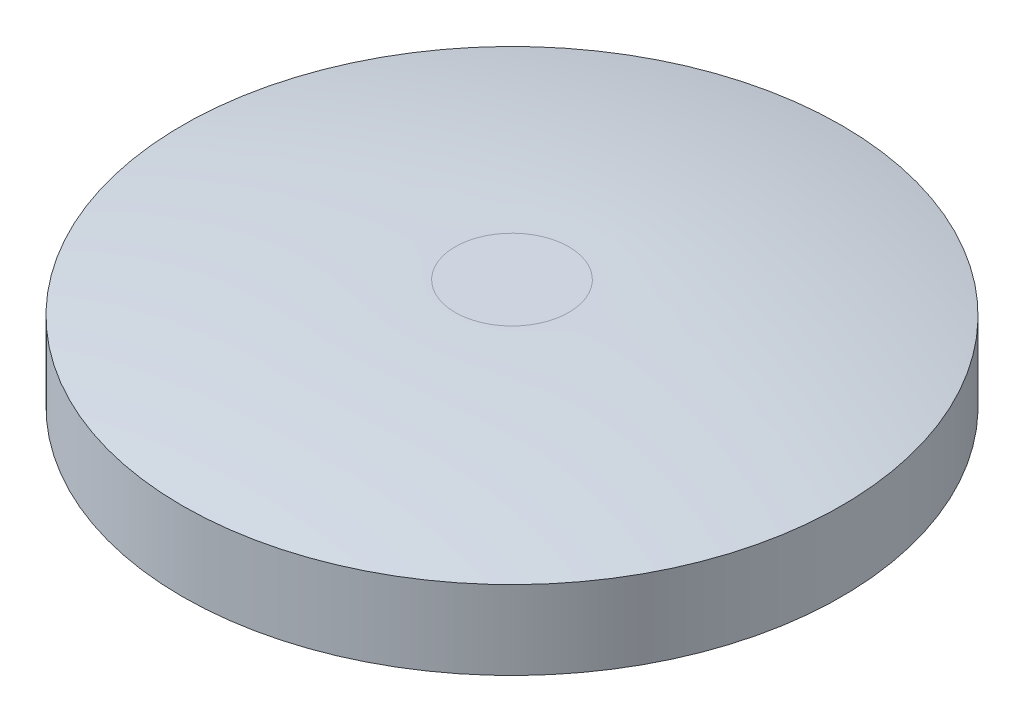
ISO-10303-21;
HEADER;
FILE_DESCRIPTION(('STEP AP214'),'2;1');
FILE_NAME('part.step','',(''),(''),'','','');
FILE_SCHEMA(('AUTOMOTIVE_DESIGN { 1 0 10303 214 1 1 1 1 }'));
ENDSEC;
DATA;
#1=APPLICATION_CONTEXT('core data for automotive mechanical design processes');
#2=APPLICATION_PROTOCOL_DEFINITION('international standard','automotive_design',2000,#1);
#3=PRODUCT_CONTEXT('',#1,'mechanical');
#4=PRODUCT('Part','Part','',(#3));
#5=PRODUCT_RELATED_PRODUCT_CATEGORY('part','',(#4));
#6=PRODUCT_DEFINITION_FORMATION('','',#4);
#7=PRODUCT_DEFINITION_CONTEXT('part definition',#1,'design');
#8=PRODUCT_DEFINITION('design','',#6,#7);
#9=PRODUCT_DEFINITION_SHAPE('','',#8);
#10=(LENGTH_UNIT() NAMED_UNIT(*) SI_UNIT(.MILLI.,.METRE.));
#11=(NAMED_UNIT(*) PLANE_ANGLE_UNIT() SI_UNIT($,.RADIAN.));
#12=(NAMED_UNIT(*) SI_UNIT($,.STERADIAN.) SOLID_ANGLE_UNIT());
#13=UNCERTAINTY_MEASURE_WITH_UNIT(LENGTH_MEASURE(1.E-05),#10,'distance_accuracy_value','');
#14=(GEOMETRIC_REPRESENTATION_CONTEXT(3) GLOBAL_UNCERTAINTY_ASSIGNED_CONTEXT((#13)) GLOBAL_UNIT_ASSIGNED_CONTEXT((#10,
#11,#12)) REPRESENTATION_CONTEXT('',''));
#15=CARTESIAN_POINT('',(0.,0.,0.));
#16=DIRECTION('',(0.,0.,1.));
#17=DIRECTION('',(1.,0.,0.));
#18=AXIS2_PLACEMENT_3D('',#15,#16,#17);
#19=CARTESIAN_POINT('',(0.,1.,0.));
#20=DIRECTION('',(0.,1.,0.));
#21=DIRECTION('',(0.,0.,1.));
#22=AXIS2_PLACEMENT_3D('',#19,#20,#21);
#23=PLANE('',#22);
#24=CARTESIAN_POINT('',(-1.21702915796217E-12,0.999999999999487,0.));
#25=DIRECTION('',(0.,1.,0.));
#26=DIRECTION('',(0.,0.,1.));
#27=AXIS2_PLACEMENT_3D('',#24,#25,#26);
#28=CIRCLE('',#27,5.869643720003);
#29=CARTESIAN_POINT('',(-1.21702915796217E-12,0.999999999999487,5.869643720003));
#30=VERTEX_POINT('',#29);
#31=EDGE_CURVE('E21',#30,#30,#28,.F.);
#32=ORIENTED_EDGE('',*,*,#31,.T.);
#33=EDGE_LOOP('',(#32));
#34=FACE_BOUND('',#33,.T.);
#35=ADVANCED_FACE('F16',(#34),#23,.F.);
#36=CARTESIAN_POINT('',(-1.2170711487236E-12,-73.072771739869,0.));
#37=DIRECTION('',(0.,1.,0.));
#38=DIRECTION('',(0.,0.,1.));
#39=AXIS2_PLACEMENT_3D('',#36,#37,#38);
#40=DEGENERATE_TOROIDAL_SURFACE('',#39,5.86964372000849,74.0727717398685,.T.);
#41=ORIENTED_EDGE('',*,*,#31,.F.);
#42=EDGE_LOOP('',(#41));
#43=FACE_BOUND('',#42,.T.);
#44=CARTESIAN_POINT('',(0.,0.,0.));
#45=DIRECTION('',(0.,1.,0.));
#46=DIRECTION('',(0.,0.,1.));
#47=AXIS2_PLACEMENT_3D('',#44,#45,#46);
#48=CIRCLE('',#47,18.);
#49=CARTESIAN_POINT('',(0.,0.,18.));
#50=VERTEX_POINT('',#49);
#51=EDGE_CURVE('E35',#50,#50,#48,.T.);
#52=ORIENTED_EDGE('',*,*,#51,.F.);
#53=EDGE_LOOP('',(#52));
#54=FACE_BOUND('',#53,.T.);
#55=ADVANCED_FACE('F40',(#43,#54),#40,.F.);
#56=CARTESIAN_POINT('',(0.,6.,0.));
#57=DIRECTION('',(0.,1.,0.));
#58=DIRECTION('',(0.,0.,1.));
#59=AXIS2_PLACEMENT_3D('',#56,#57,#58);
#60=PLANE('',#59);
#61=CARTESIAN_POINT('',(2.33026192273726E-12,5.99999999999986,3.10527525103699));
#62=CARTESIAN_POINT('',(-0.0557798827298015,5.99999999997448,3.10525667714382));
#63=CARTESIAN_POINT('',(-0.1115580223475,5.99999999999398,3.10375197361228));
#64=CARTESIAN_POINT('',(-0.222956271130952,6.00000000000563,3.09777808126887));
#65=CARTESIAN_POINT('',(-0.278576377596615,5.99999999999778,3.09330884210839));
#66=CARTESIAN_POINT('',(-0.389505027845718,5.9999999998376,3.08141334082715));
#67=CARTESIAN_POINT('',(-0.444813555087367,5.99999999968527,3.07398692318208));
#68=CARTESIAN_POINT('',(-0.527418920552798,5.99999999899345,3.0606569331651));
#69=CARTESIAN_POINT('',(-0.554896522256398,5.99999999868558,3.0558480990134));
#70=CARTESIAN_POINT('',(-0.609675053168411,5.99999999798358,3.04549335554243));
#71=CARTESIAN_POINT('',(-0.636976168386664,5.99999999758955,3.03994843243975));
#72=CARTESIAN_POINT('',(-0.718631883859921,5.99999999668156,3.02217406949885));
#73=CARTESIAN_POINT('',(-0.772742197112823,5.99999999644158,3.00880450143616));
#74=CARTESIAN_POINT('',(-0.880149008842378,5.99999999693832,2.97912693977043));
#75=CARTESIAN_POINT('',(-0.933445524723966,5.99999999767502,2.96281900910681));
#76=CARTESIAN_POINT('',(-1.03900288920495,5.99999999909743,2.92716058608882));
#77=CARTESIAN_POINT('',(-1.09126384431346,5.99999999978313,2.90781040848278));
#78=CARTESIAN_POINT('',(-1.1799554432403,6.00000000015442,2.87258527487248));
#79=CARTESIAN_POINT('',(-1.21662660155596,6.00000000007048,2.85730576259389));
#80=CARTESIAN_POINT('',(-1.31397462866956,5.99999999979306,2.814539379831));
#81=CARTESIAN_POINT('',(-1.37410798709275,5.99999999956389,2.78578717779275));
#82=CARTESIAN_POINT('',(-1.44876891650492,5.99999999883825,2.74709879587628));
#83=CARTESIAN_POINT('',(-1.46423032259533,5.99999999866347,2.73892075596955));
#84=CARTESIAN_POINT('',(-1.53394517491911,5.99999999784658,2.70128092837278));
#85=CARTESIAN_POINT('',(-1.58740042823527,5.99999999714062,2.67030540781104));
#86=CARTESIAN_POINT('',(-1.66188932940621,5.99999999659025,2.62406229104348));
#87=CARTESIAN_POINT('',(-1.68374872261745,5.99999999648363,2.61010182936937));
#88=CARTESIAN_POINT('',(-1.73066216884211,5.9999999963933,2.57929137634363));
#89=CARTESIAN_POINT('',(-1.75565188211689,5.99999999643263,2.5623431245629));
#90=CARTESIAN_POINT('',(-1.82985145940309,5.99999999668454,2.51040409855918));
#91=CARTESIAN_POINT('',(-1.87829815982521,5.99999999703102,2.47431511543034));
#92=CARTESIAN_POINT('',(-1.97299116018061,5.99999999799499,2.39936455140583));
#93=CARTESIAN_POINT('',(-2.01923757603544,5.99999999861247,2.36050311684643));
#94=CARTESIAN_POINT('',(-2.1092905844008,5.99999999956369,2.28005914985439));
#95=CARTESIAN_POINT('',(-2.1530973991718,5.99999999989746,2.23847686605859));
#96=CARTESIAN_POINT('',(-2.22503397655281,6.00000000007012,2.16645279500627));
#97=CARTESIAN_POINT('',(-2.25376866232929,6.00000000003145,2.13661083354845));
#98=CARTESIAN_POINT('',(-2.30147973850993,5.99999999990851,2.08505181862818));
#99=CARTESIAN_POINT('',(-2.32076710864066,5.99999999984167,2.06362266439735));
#100=CARTESIAN_POINT('',(-2.36352001486921,5.99999999956038,2.01478212739965));
#101=CARTESIAN_POINT('',(-2.38681592620388,5.99999999931303,1.98722205931191));
#102=CARTESIAN_POINT('',(-2.43629575790204,5.9999999986314,1.926564630304));
#103=CARTESIAN_POINT('',(-2.46229999976722,5.99999999817256,1.89332042892011));
#104=CARTESIAN_POINT('',(-2.50982402826319,5.99999999736512,1.8299092635605));
#105=CARTESIAN_POINT('',(-2.531503738188,5.99999999700991,1.79986204328958));
#106=CARTESIAN_POINT('',(-2.56741150115898,5.99999999661186,1.74813126005927));
#107=CARTESIAN_POINT('',(-2.58192316144935,5.99999999650726,1.726644094921));
#108=CARTESIAN_POINT('',(-2.61273540183945,5.99999999641827,1.67974220929204));
#109=CARTESIAN_POINT('',(-2.62893754972517,5.99999999645647,1.65426287544022));
#110=CARTESIAN_POINT('',(-2.67640579948156,5.99999999670737,1.57712692664554));
#111=CARTESIAN_POINT('',(-2.70653801270414,5.9999999970563,1.52476621189469));
#112=CARTESIAN_POINT('',(-2.76366328107758,5.99999999800282,1.41836702041648));
#113=CARTESIAN_POINT('',(-2.79065650114772,5.99999999860039,1.36432863202142));
#114=CARTESIAN_POINT('',(-2.84139082351762,5.99999999958782,1.25475084904769));
#115=CARTESIAN_POINT('',(-2.86513222138676,5.9999999999777,1.19921159143837));
#116=CARTESIAN_POINT('',(-2.90767685853559,6.00000000002033,1.09114706245834));
#117=CARTESIAN_POINT('',(-2.92671870231919,5.99999999972709,1.03871531445593));
#118=CARTESIAN_POINT('',(-2.9620722134773,5.99999999948907,0.932940241277406));
#119=CARTESIAN_POINT('',(-2.97838395332802,5.99999999954429,0.87959694034179));
#120=CARTESIAN_POINT('',(-3.00816820783421,6.00000000006989,0.772118869706534));
#121=CARTESIAN_POINT('',(-3.0216405187127,6.0000000005403,0.717984043499527));
#122=CARTESIAN_POINT('',(-3.03982075008255,5.99999999925814,0.636330711923945));
#123=CARTESIAN_POINT('',(-3.04554325895609,5.99999999849928,0.609034999911849));
#124=CARTESIAN_POINT('',(-3.05314442550151,5.99999999797591,0.569584501975838));
#125=CARTESIAN_POINT('',(-3.05538296321541,5.99999999789266,0.557499287624373));
#126=CARTESIAN_POINT('',(-3.06330185461688,5.99999999777636,0.513165190900821));
#127=CARTESIAN_POINT('',(-3.06851010152395,5.99999999805749,0.480831722837093));
#128=CARTESIAN_POINT('',(-3.08066711761153,5.99999999871544,0.396902197917423));
#129=CARTESIAN_POINT('',(-3.0868312739591,5.99999999905092,0.345190192173577));
#130=CARTESIAN_POINT('',(-3.09450457343303,5.9999999994886,0.26327693948771));
#131=CARTESIAN_POINT('',(-3.0968816857392,5.99999999962962,0.233153874706185));
#132=CARTESIAN_POINT('',(-3.10043679316484,5.99999999981965,0.177875371750722));
#133=CARTESIAN_POINT('',(-3.10174859318507,5.99999999988007,0.152728534843713));
#134=CARTESIAN_POINT('',(-3.10445936537743,5.99999999998747,0.0850703439177172));
#135=CARTESIAN_POINT('',(-3.10529535575089,5.99999999999648,0.0425356281595641));
#136=CARTESIAN_POINT('',(-3.10524892583805,6.00000000000429,-0.055696334708853));
#137=CARTESIAN_POINT('',(-3.10375479167715,5.99999999999906,-0.111394233766092));
#138=CARTESIAN_POINT('',(-3.09776151034657,5.99999999999288,-0.222627459760753));
#139=CARTESIAN_POINT('',(-3.09326237933502,5.99999999999193,-0.278162787570723));
#140=CARTESIAN_POINT('',(-3.08129188903354,5.99999999999097,-0.388911904631839));
#141=CARTESIAN_POINT('',(-3.0738205342776,5.99999999999098,-0.444125694373348));
#142=CARTESIAN_POINT('',(-3.05592172811457,5.99999999999315,-0.554072531681186));
#143=CARTESIAN_POINT('',(-3.04549426983111,5.99999999999531,-0.608805578128925));
#144=CARTESIAN_POINT('',(-3.02171520301367,5.99999999999899,-0.717632012140015));
#145=CARTESIAN_POINT('',(-3.00836357641531,6.00000000000051,-0.7717253957496));
#146=CARTESIAN_POINT('',(-2.97877246904153,5.99999999999863,-0.879120973292945));
#147=CARTESIAN_POINT('',(-2.96253295930416,5.99999999999522,-0.932423159286151));
#148=CARTESIAN_POINT('',(-2.93781300591527,5.99999999998188,-1.00637495735342));
#149=CARTESIAN_POINT('',(-2.9305228288928,5.99999999997708,-1.02742870758817));
#150=CARTESIAN_POINT('',(-2.91082263877145,5.99999999996189,-1.08240230588175));
#151=CARTESIAN_POINT('',(-2.89804508959417,5.99999999994986,-1.11619115399598));
#152=CARTESIAN_POINT('',(-2.86240925475575,5.99999999991248,-1.20567264069874));
#153=CARTESIAN_POINT('',(-2.83850849150237,5.99999999988361,-1.26095352676315));
#154=CARTESIAN_POINT('',(-2.78753425443161,5.99999999981627,-1.37003070328919));
#155=CARTESIAN_POINT('',(-2.76046073213231,5.9999999997778,-1.4238269710493));
#156=CARTESIAN_POINT('',(-2.70323120166492,5.99999999969326,-1.52975594568429));
#157=CARTESIAN_POINT('',(-2.67307514901012,5.99999999964718,-1.58188862853626));
#158=CARTESIAN_POINT('',(-2.60978285248862,5.9999999995491,-1.68431315036905));
#159=CARTESIAN_POINT('',(-2.576646568141,5.99999999949711,-1.73460496433202));
#160=CARTESIAN_POINT('',(-2.5075057575613,5.99999999938883,-1.83317775289258));
#161=CARTESIAN_POINT('',(-2.4715011948032,5.99999999933255,-1.88145870187093));
#162=CARTESIAN_POINT('',(-2.39674560837815,5.99999999921728,-1.97584626992498));
#163=CARTESIAN_POINT('',(-2.35799455206675,5.99999999915829,-2.02195286314574));
#164=CARTESIAN_POINT('',(-2.27787702455669,5.99999999903879,-2.11183571740905));
#165=CARTESIAN_POINT('',(-2.23651052449058,5.99999999897829,-2.15561195272091));
#166=CARTESIAN_POINT('',(-2.15130203848558,5.99999999885794,-2.24068574680227));
#167=CARTESIAN_POINT('',(-2.1074600273242,5.99999999879809,-2.28198328030793));
#168=CARTESIAN_POINT('',(-2.01744876540565,5.99999999867709,-2.3619604933229));
#169=CARTESIAN_POINT('',(-1.97127949291105,5.99999999861594,-2.40064014837243));
#170=CARTESIAN_POINT('',(-1.87878398491679,5.99999999850758,-2.47365856581796));
#171=CARTESIAN_POINT('',(-1.83254826247256,5.99999999845989,-2.50811206623986));
#172=CARTESIAN_POINT('',(-1.73822864101199,5.99999999838952,-2.57438997142164));
#173=CARTESIAN_POINT('',(-1.69014473308487,5.99999999836683,-2.60621436350331));
#174=CARTESIAN_POINT('',(-1.59227878197979,5.99999999834499,-2.66713518338707));
#175=CARTESIAN_POINT('',(-1.54249673622216,5.99999999834584,-2.69623160704481));
#176=CARTESIAN_POINT('',(-1.44138912538885,5.99999999837179,-2.75160599433959));
#177=CARTESIAN_POINT('',(-1.39006356306631,5.99999999839689,-2.77788396300347));
#178=CARTESIAN_POINT('',(-1.28602853674634,5.9999999984695,-2.8275397588422));
#179=CARTESIAN_POINT('',(-1.23331907978922,5.999999998517,-2.85091760076747));
#180=CARTESIAN_POINT('',(-1.12668014148764,5.9999999986312,-2.89470048956303));
#181=CARTESIAN_POINT('',(-1.07275067038184,5.99999999869789,-2.91510556137088));
#182=CARTESIAN_POINT('',(-0.963839394097057,5.99999999884562,-2.95287951779896));
#183=CARTESIAN_POINT('',(-0.908857601229356,5.99999999892665,-2.97024843791556));
#184=CARTESIAN_POINT('',(-0.798012644647377,5.99999999909659,-3.00189617241869));
#185=CARTESIAN_POINT('',(-0.742149494161611,5.99999999918551,-3.01617503313743));
#186=CARTESIAN_POINT('',(-0.629715525651068,5.9999999993632,-3.04159830784609));
#187=CARTESIAN_POINT('',(-0.573144720593973,5.99999999945198,-3.05274277918566));
#188=CARTESIAN_POINT('',(-0.459471356452962,5.99999999961973,-3.07186289229995));
#189=CARTESIAN_POINT('',(-0.402368808882073,5.99999999969869,-3.07983860252061));
#190=CARTESIAN_POINT('',(-0.287809483080168,5.99999999983568,-3.0925959702412));
#191=CARTESIAN_POINT('',(-0.230352713706643,5.9999999998937,-3.09737770728371));
#192=CARTESIAN_POINT('',(-0.115263714928813,5.99999999997565,-3.10373452302853));
#193=CARTESIAN_POINT('',(-0.0576314905197108,5.99999999999957,-3.1053096921824));
#194=CARTESIAN_POINT('',(0.,5.99999999999986,-3.105275251037));
#195=B_SPLINE_CURVE_WITH_KNOTS('',3,(#61,#62,#63,#64,#65,#66,#67,#68,#69,#70,#71,#72,#73,#74,
#75,#76,#77,#78,#79,#80,#81,#82,#83,#84,#85,#86,#87,#88,#89,#90,#91,#92,#93,#94,#95,#96,#97,#98,
#99,#100,#101,#102,#103,#104,#105,#106,#107,#108,#109,#110,#111,#112,#113,#114,#115,#116,#117,
#118,#119,#120,#121,#122,#123,#124,#125,#126,#127,#128,#129,#130,#131,#132,#133,#134,#135,#136,
#137,#138,#139,#140,#141,#142,#143,#144,#145,#146,#147,#148,#149,#150,#151,#152,#153,#154,#155,
#156,#157,#158,#159,#160,#161,#162,#163,#164,#165,#166,#167,#168,#169,#170,#171,#172,#173,#174,
#175,#176,#177,#178,#179,#180,#181,#182,#183,#184,#185,#186,#187,#188,#189,#190,#191,#192,#193,
#194),.UNSPECIFIED.,.F.,.F.,(4,2,2,2,2,2,2,2,2,2,2,2,2,2,2,2,2,2,2,2,2,2,2,2,2,2,2,2,2,2,2,2,2,
2,2,2,2,2,2,2,2,2,2,2,2,2,2,2,2,2,2,2,2,2,2,2,2,2,2,2,2,2,2,2,2,2,4),(0.,0.167317473088868,
0.334637787910105,0.50196690362594,0.585644034649692,0.669210165197918,0.836332283902437,
1.00345082329424,1.17055208410518,1.28971767775962,1.48950221722547,1.54197569174973,
1.72717397588154,1.80497955287813,1.89555177300485,2.07667370848187,2.25778609099577,
2.43888194613634,2.56313675299034,2.6496181413211,2.75785686085035,2.88443985368734,
2.99557067449784,3.07334793677577,3.16392008929676,3.34504190190418,3.52615419426609,
3.70725001376494,3.87452297863889,4.04179150220469,4.20907202602747,4.29272902491159,
4.32960023701195,4.42783444008697,4.58399403472865,4.67463287598574,4.7501690457977,
4.8777629988914,5.04483507060676,5.211906243969,5.37897716247286,5.54604846961303,
5.71312080888425,5.88019482378119,5.947031798223,6.05538287200558,6.23595401398446,
6.41652791557361,6.5971044235515,6.77768338469658,6.95826464578731,7.13884805360215,
7.31943345491954,7.50002069651794,7.68060962517579,7.85350368730167,8.02639858311646,
8.19929374159003,8.37218859169224,8.54508256239297,8.71797508266209,8.89086558146952,
9.06375348778523,9.23663823057923,9.40951923882161,9.58239594148251,9.7552677675322),.UNSPECIFIED.);
#196=CARTESIAN_POINT('',(1.2009834083219E-12,5.99999999999987,3.10527525103837));
#197=VERTEX_POINT('',#196);
#198=CARTESIAN_POINT('',(0.,5.99999999999986,-3.10527525103699));
#199=VERTEX_POINT('',#198);
#200=EDGE_CURVE('E32',#197,#199,#195,.T.);
#201=ORIENTED_EDGE('',*,*,#200,.F.);
#202=CARTESIAN_POINT('',(0.,5.99999999999986,-3.10527525103699));
#203=CARTESIAN_POINT('',(0.0557798842962643,5.99999999997455,-3.10525674296275));
#204=CARTESIAN_POINT('',(0.111558027023968,5.99999999999405,-3.10375208565289));
#205=CARTESIAN_POINT('',(0.222956283029275,6.00000000000559,-3.09777824836192));
#206=CARTESIAN_POINT('',(0.278576393602465,5.99999999999763,-3.09330901795113));
#207=CARTESIAN_POINT('',(0.389505047393207,5.99999999983721,-3.08141349863922));
#208=CARTESIAN_POINT('',(0.444813574071818,5.99999999968474,-3.07398705424077));
#209=CARTESIAN_POINT('',(0.527418930538099,5.99999999899311,-3.06065699194556));
#210=CARTESIAN_POINT('',(0.554896527498111,5.99999999868537,-3.05584812842277));
#211=CARTESIAN_POINT('',(0.609675047199992,5.99999999798379,-3.04549332631053));
#212=CARTESIAN_POINT('',(0.636976155956768,5.99999999759006,-3.03994837395763));
#213=CARTESIAN_POINT('',(0.718631853580884,5.99999999668284,-3.02217394126999));
#214=CARTESIAN_POINT('',(0.772742158390691,5.99999999644324,-3.00880435048347));
#215=CARTESIAN_POINT('',(0.880148957918645,5.99999999694002,-2.97912676785271));
#216=CARTESIAN_POINT('',(0.933445470048932,5.99999999767639,-2.9628188389738));
#217=CARTESIAN_POINT('',(1.03900285651854,5.999999999098,-2.9271604909907));
#218=CARTESIAN_POINT('',(1.09126383733846,5.99999999978326,-2.90781038655173));
#219=CARTESIAN_POINT('',(1.17995649698792,6.00000000015433,-2.87258487397739));
#220=CARTESIAN_POINT('',(1.21662868538145,6.00000000007045,-2.85730489973758));
#221=CARTESIAN_POINT('',(1.31397666264529,5.99999999979311,-2.81453840047805));
#222=CARTESIAN_POINT('',(1.37410898758829,5.99999999956389,-2.7857866584996));
#223=CARTESIAN_POINT('',(1.44876891743442,5.99999999883825,-2.7470987956177));
#224=CARTESIAN_POINT('',(1.46423032438027,5.99999999866347,-2.73892075511426));
#225=CARTESIAN_POINT('',(1.53394517806101,5.99999999784658,-2.70128092629657));
#226=CARTESIAN_POINT('',(1.58740043196616,5.99999999714062,-2.67030540556934));
#227=CARTESIAN_POINT('',(1.66188933222321,5.99999999659025,-2.624062289272));
#228=CARTESIAN_POINT('',(1.68374872401353,5.99999999648363,-2.61010182846245));
#229=CARTESIAN_POINT('',(1.73066216883844,5.9999999963933,-2.57929137633474));
#230=CARTESIAN_POINT('',(1.7556518821115,5.99999999643263,-2.56234312455447));
#231=CARTESIAN_POINT('',(1.82985145939262,5.99999999668454,-2.51040409854879));
#232=CARTESIAN_POINT('',(1.87829815981167,5.99999999703102,-2.47431511541414));
#233=CARTESIAN_POINT('',(1.97299116016482,5.99999999799499,-2.39936455138616));
#234=CARTESIAN_POINT('',(2.01923757602045,5.99999999861247,-2.3605031168291));
#235=CARTESIAN_POINT('',(2.10929058439001,5.99999999956369,-2.28005914984296));
#236=CARTESIAN_POINT('',(2.15309739916438,5.99999999989746,-2.23847686605071));
#237=CARTESIAN_POINT('',(2.22503397551307,6.00000000007012,-2.16645279605777));
#238=CARTESIAN_POINT('',(2.25376866029015,6.00000000003145,-2.13661083569158));
#239=CARTESIAN_POINT('',(2.30147973585481,5.99999999990851,-2.08505182158606));
#240=CARTESIAN_POINT('',(2.32076710631862,5.99999999984167,-2.06362266703277));
#241=CARTESIAN_POINT('',(2.36352001356345,5.99999999956038,-2.01478212895907));
#242=CARTESIAN_POINT('',(2.38681592556431,5.99999999931303,-1.98722206010269));
#243=CARTESIAN_POINT('',(2.43629576082963,5.9999999986314,-1.92656462670718));
#244=CARTESIAN_POINT('',(2.46230000547676,5.99999999817256,-1.89332042160689));
#245=CARTESIAN_POINT('',(2.50982403615952,5.99999999736512,-1.82990925273396));
#246=CARTESIAN_POINT('',(2.53150374565731,5.99999999700991,-1.79986203279073));
#247=CARTESIAN_POINT('',(2.56741150577618,5.99999999661186,-1.74813125322696));
#248=CARTESIAN_POINT('',(2.5819231637148,5.99999999650726,-1.72664409147655));
#249=CARTESIAN_POINT('',(2.61273540183725,5.99999999641827,-1.67974220929076));
#250=CARTESIAN_POINT('',(2.62893754971863,5.99999999645647,-1.65426287543613));
#251=CARTESIAN_POINT('',(2.67640579946492,5.99999999670737,-1.57712692663548));
#252=CARTESIAN_POINT('',(2.7065380126848,5.9999999970563,-1.52476621188375));
#253=CARTESIAN_POINT('',(2.76366328105597,5.99999999800282,-1.4183670204054));
#254=CARTESIAN_POINT('',(2.79065650112653,5.99999999860039,-1.36432863201111));
#255=CARTESIAN_POINT('',(2.84139082350379,5.99999999958782,-1.25475084904144));
#256=CARTESIAN_POINT('',(2.86513222137986,5.9999999999777,-1.19921159143541));
#257=CARTESIAN_POINT('',(2.9076768585421,6.00000000002033,-1.09114706246076));
#258=CARTESIAN_POINT('',(2.92671870233216,5.99999999972709,-1.03871531446047));
#259=CARTESIAN_POINT('',(2.96207221349837,5.99999999948907,-0.93294024128402));
#260=CARTESIAN_POINT('',(2.97838395335072,5.99999999954429,-0.879596940348349));
#261=CARTESIAN_POINT('',(3.00816820785293,6.00000000006989,-0.772118869711412));
#262=CARTESIAN_POINT('',(3.0216405187258,6.0000000005403,-0.71798404350278));
#263=CARTESIAN_POINT('',(3.03982075009171,5.99999999925814,-0.636330711925785));
#264=CARTESIAN_POINT('',(3.04554325896468,5.99999999849928,-0.609034999913442));
#265=CARTESIAN_POINT('',(3.05314442531413,5.99999999797591,-0.569584502927892));
#266=CARTESIAN_POINT('',(3.05538296285279,5.99999999789266,-0.557499289530919));
#267=CARTESIAN_POINT('',(3.06330185409462,5.99999999777636,-0.513165193887961));
#268=CARTESIAN_POINT('',(3.06851010101654,5.99999999805749,-0.4808317259498));
#269=CARTESIAN_POINT('',(3.08066711733903,5.99999999871544,-0.396902200084383));
#270=CARTESIAN_POINT('',(3.08683127384989,5.99999999905092,-0.345190193259793));
#271=CARTESIAN_POINT('',(3.09450457379543,5.9999999994886,-0.263276935665271));
#272=CARTESIAN_POINT('',(3.0968816863522,5.99999999962962,-0.233153867051065));
#273=CARTESIAN_POINT('',(3.10043679393742,5.99999999981965,-0.177875358509832));
#274=CARTESIAN_POINT('',(3.10174859393619,5.99999999988007,-0.152728519853723));
#275=CARTESIAN_POINT('',(3.10445936561013,5.99999999998747,-0.0850703327486668));
#276=CARTESIAN_POINT('',(3.10529535575223,5.99999999999648,-0.0425356225753259));
#277=CARTESIAN_POINT('',(3.10524892583284,6.00000000000429,0.0556963347080387));
#278=CARTESIAN_POINT('',(3.10375479167575,5.99999999999906,0.111394233765858));
#279=CARTESIAN_POINT('',(3.09776151034797,5.99999999999288,0.222627459760932));
#280=CARTESIAN_POINT('',(3.09326237933541,5.99999999999193,0.278162787570734));
#281=CARTESIAN_POINT('',(3.08129188903317,5.99999999999097,0.388911904631713));
#282=CARTESIAN_POINT('',(3.0738205342775,5.99999999999098,0.444125694373253));
#283=CARTESIAN_POINT('',(3.05592172811467,5.99999999999315,0.554072531681104));
#284=CARTESIAN_POINT('',(3.04549426983116,5.99999999999531,0.608805578128827));
#285=CARTESIAN_POINT('',(3.02171520301367,5.99999999999899,0.717632012139887));
#286=CARTESIAN_POINT('',(3.00836357641531,6.00000000000051,0.771725395749459));
#287=CARTESIAN_POINT('',(2.97877246904152,5.99999999999863,0.879120973292779));
#288=CARTESIAN_POINT('',(2.96253295930416,5.99999999999522,0.932423159285974));
#289=CARTESIAN_POINT('',(2.93781300591527,5.99999999998188,1.00637495735323));
#290=CARTESIAN_POINT('',(2.93052282889281,5.99999999997708,1.02742870758797));
#291=CARTESIAN_POINT('',(2.91082263877146,5.99999999996189,1.08240230588155));
#292=CARTESIAN_POINT('',(2.89804508959416,5.99999999994986,1.11619115399577));
#293=CARTESIAN_POINT('',(2.86240925475574,5.99999999991248,1.20567264069851));
#294=CARTESIAN_POINT('',(2.83850849150237,5.99999999988361,1.26095352676292));
#295=CARTESIAN_POINT('',(2.78753425443164,5.99999999981627,1.37003070328895));
#296=CARTESIAN_POINT('',(2.76046073213236,5.9999999997778,1.42382697104907));
#297=CARTESIAN_POINT('',(2.70323120166497,5.99999999969326,1.52975594568404));
#298=CARTESIAN_POINT('',(2.67307514901016,5.99999999964718,1.581888628536));
#299=CARTESIAN_POINT('',(2.60978285248867,5.9999999995491,1.68431315036877));
#300=CARTESIAN_POINT('',(2.57664656814107,5.99999999949711,1.73460496433174));
#301=CARTESIAN_POINT('',(2.50750575756141,5.99999999938883,1.8331777528923));
#302=CARTESIAN_POINT('',(2.47150119480332,5.99999999933255,1.88145870187065));
#303=CARTESIAN_POINT('',(2.3967456083783,5.99999999921728,1.97584626992471));
#304=CARTESIAN_POINT('',(2.35799455206692,5.99999999915829,2.02195286314547));
#305=CARTESIAN_POINT('',(2.27787702455688,5.99999999903879,2.11183571740879));
#306=CARTESIAN_POINT('',(2.23651052449078,5.99999999897829,2.15561195272065));
#307=CARTESIAN_POINT('',(2.15130203848581,5.99999999885794,2.24068574680202));
#308=CARTESIAN_POINT('',(2.10746002732445,5.99999999879809,2.28198328030768));
#309=CARTESIAN_POINT('',(2.01744876540593,5.99999999867709,2.36196049332267));
#310=CARTESIAN_POINT('',(1.97127949291135,5.99999999861594,2.40064014837221));
#311=CARTESIAN_POINT('',(1.87878398491706,5.99999999850758,2.47365856581782));
#312=CARTESIAN_POINT('',(1.83254826247279,5.99999999845989,2.50811206623979));
#313=CARTESIAN_POINT('',(1.73822864101211,5.99999999838952,2.57438997142168));
#314=CARTESIAN_POINT('',(1.69014473308492,5.99999999836683,2.6062143635034));
#315=CARTESIAN_POINT('',(1.59227878197972,5.99999999834499,2.66713518338725));
#316=CARTESIAN_POINT('',(1.54249673622203,5.99999999834584,2.69623160704503));
#317=CARTESIAN_POINT('',(1.44138912538859,5.99999999837179,2.75160599433989));
#318=CARTESIAN_POINT('',(1.39006356306598,5.99999999839689,2.77788396300381));
#319=CARTESIAN_POINT('',(1.28602853674585,5.9999999984695,2.82753975884258));
#320=CARTESIAN_POINT('',(1.23331907978866,5.999999998517,2.85091760076786));
#321=CARTESIAN_POINT('',(1.12668014148692,5.9999999986312,2.89470048956346));
#322=CARTESIAN_POINT('',(1.07275067038104,5.99999999869789,2.91510556137133));
#323=CARTESIAN_POINT('',(0.963839394096104,5.99999999884562,2.95287951779943));
#324=CARTESIAN_POINT('',(0.908857601228321,5.99999999892665,2.97024843791603));
#325=CARTESIAN_POINT('',(0.79801264464618,5.99999999909659,3.00189617241916));
#326=CARTESIAN_POINT('',(0.742149494160335,5.99999999918551,3.01617503313791));
#327=CARTESIAN_POINT('',(0.629715525649623,5.9999999993632,3.04159830784652));
#328=CARTESIAN_POINT('',(0.573144720592439,5.99999999945198,3.05274277918605));
#329=CARTESIAN_POINT('',(0.459471356451262,5.99999999961973,3.07186289230029));
#330=CARTESIAN_POINT('',(0.402368808880294,5.99999999969869,3.07983860252094));
#331=CARTESIAN_POINT('',(0.28780948307823,5.99999999983568,3.09259597024147));
#332=CARTESIAN_POINT('',(0.230352713704624,5.9999999998937,3.09737770728392));
#333=CARTESIAN_POINT('',(0.115263714926634,5.99999999997565,3.10373452302862));
#334=CARTESIAN_POINT('',(0.0576314905174534,5.99999999999957,3.10530969218243));
#335=CARTESIAN_POINT('',(-2.33102249581659E-12,5.99999999999986,3.105275251037));
#336=B_SPLINE_CURVE_WITH_KNOTS('',3,(#202,#203,#204,#205,#206,#207,#208,#209,#210,#211,#212,
#213,#214,#215,#216,#217,#218,#219,#220,#221,#222,#223,#224,#225,#226,#227,#228,#229,#230,#231,
#232,#233,#234,#235,#236,#237,#238,#239,#240,#241,#242,#243,#244,#245,#246,#247,#248,#249,#250,
#251,#252,#253,#254,#255,#256,#257,#258,#259,#260,#261,#262,#263,#264,#265,#266,#267,#268,#269,
#270,#271,#272,#273,#274,#275,#276,#277,#278,#279,#280,#281,#282,#283,#284,#285,#286,#287,#288,
#289,#290,#291,#292,#293,#294,#295,#296,#297,#298,#299,#300,#301,#302,#303,#304,#305,#306,#307,
#308,#309,#310,#311,#312,#313,#314,#315,#316,#317,#318,#319,#320,#321,#322,#323,#324,#325,#326,
#327,#328,#329,#330,#331,#332,#333,#334,#335),.UNSPECIFIED.,.F.,.F.,(4,2,2,2,2,2,2,2,2,2,2,2,2,
2,2,2,2,2,2,2,2,2,2,2,2,2,2,2,2,2,2,2,2,2,2,2,2,2,2,2,2,2,2,2,2,2,2,2,2,2,2,2,2,2,2,2,2,2,2,2,2,
2,2,2,2,2,4),(0.,0.167317476852337,0.334637799977043,0.501966922363872,0.585644054368138,
0.669210183659412,0.836332295571299,1.00345082666616,1.17055208333569,1.28972105912676,
1.48950221766801,1.54197569519365,1.72717398132594,1.80497955332012,1.89555177344676,
2.07667370892295,2.25778609143578,2.43888194657592,2.56313674899464,2.64961813871201,
2.75785686129126,2.884439868039,2.99557068730407,3.07334793721474,3.16392008973555,
3.34504190234195,3.52615419470259,3.70725001420082,3.87452297907525,4.04179150264213,
4.20907202646576,4.29272902535001,4.32960023453931,4.42783443725004,4.58399403516504,
4.674632887939,4.75016906298585,4.87776299933038,5.04483507104571,5.21190624440793,
5.37897716291175,5.5460484700519,5.71312080932309,5.88019482421999,5.94703179866178,
6.05538287244435,6.23595401442321,6.41652791601234,6.5971044239902,6.77768338513525,
6.95826464622596,7.13884805404077,7.31943345535814,7.50002069695652,7.68060962561435,
7.85350368774046,8.02639858355548,8.19929374202929,8.37218859213173,8.54508256283269,
8.71797508310205,8.89086558190971,9.06375348822566,9.23663823101989,9.40951923926249,
9.58239594192363,9.75526776797354),.UNSPECIFIED.);
#337=EDGE_CURVE('E11',#199,#197,#336,.T.);
#338=ORIENTED_EDGE('',*,*,#337,.F.);
#339=EDGE_LOOP('',(#201,#338));
#340=FACE_BOUND('',#339,.T.);
#341=ADVANCED_FACE('F37',(#340),#60,.T.);
#342=CARTESIAN_POINT('',(0.,0.,0.));
#343=DIRECTION('',(0.,1.,0.));
#344=DIRECTION('',(0.,0.,1.));
#345=AXIS2_PLACEMENT_3D('',#342,#343,#344);
#346=CYLINDRICAL_SURFACE('',#345,18.);
#347=CARTESIAN_POINT('',(-2.33840724561674E-12,4.29999999999957,-1.24465000383839E-13));
#348=DIRECTION('',(0.,1.,0.));
#349=DIRECTION('',(0.,0.,1.));
#350=AXIS2_PLACEMENT_3D('',#347,#348,#349);
#351=CIRCLE('',#350,18.0000000000006);
#352=CARTESIAN_POINT('',(-2.33840724561674E-12,4.2999999999996,18.0000000000005));
#353=VERTEX_POINT('',#352);
#354=EDGE_CURVE('E27',#353,#353,#351,.T.);
#355=ORIENTED_EDGE('',*,*,#354,.F.);
#356=EDGE_LOOP('',(#355));
#357=FACE_BOUND('',#356,.T.);
#358=ORIENTED_EDGE('',*,*,#51,.T.);
#359=EDGE_LOOP('',(#358));
#360=FACE_BOUND('',#359,.T.);
#361=ADVANCED_FACE('F39',(#357,#360),#346,.T.);
#362=CARTESIAN_POINT('',(-2.33580516040277E-12,-60.1008309844473,0.));
#363=DIRECTION('',(0.,1.,0.));
#364=DIRECTION('',(0.,0.,1.));
#365=AXIS2_PLACEMENT_3D('',#362,#363,#364);
#366=DEGENERATE_TOROIDAL_SURFACE('',#365,3.10527525104228,66.1008309844472,.T.);
#367=ORIENTED_EDGE('',*,*,#200,.T.);
#368=ORIENTED_EDGE('',*,*,#337,.T.);
#369=EDGE_LOOP('',(#367,#368));
#370=FACE_BOUND('',#369,.T.);
#371=ORIENTED_EDGE('',*,*,#354,.T.);
#372=EDGE_LOOP('',(#371));
#373=FACE_BOUND('',#372,.T.);
#374=ADVANCED_FACE('F18',(#370,#373),#366,.T.);
#375=CLOSED_SHELL('',(#35,#55,#341,#361,#374));
#376=MANIFOLD_SOLID_BREP('B1',#375);
#377=ADVANCED_BREP_SHAPE_REPRESENTATION('',(#18,#376),#14);
#378=SHAPE_DEFINITION_REPRESENTATION(#9,#377);
ENDSEC;
END-ISO-10303-21;
